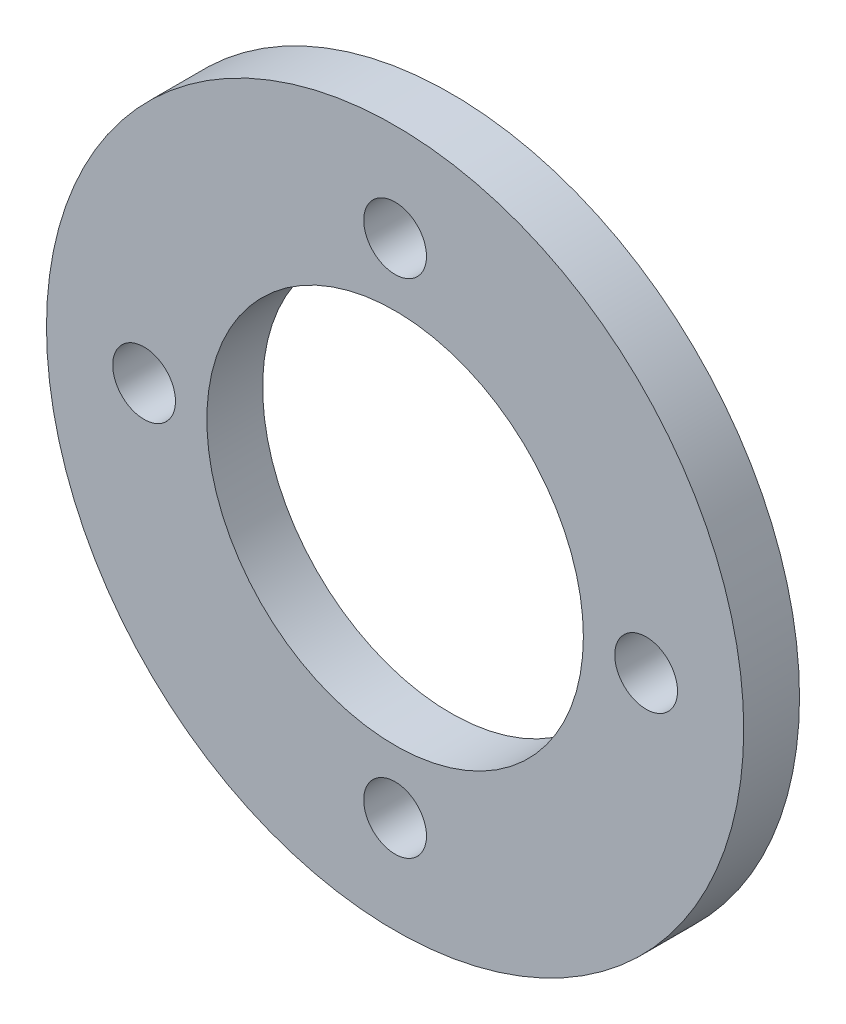
ISO-10303-21;
HEADER;
FILE_DESCRIPTION(('STEP AP214'),'2;1');
FILE_NAME('part.step','',(''),(''),'','','');
FILE_SCHEMA(('AUTOMOTIVE_DESIGN { 1 0 10303 214 1 1 1 1 }'));
ENDSEC;
DATA;
#1=APPLICATION_CONTEXT('core data for automotive mechanical design processes');
#2=APPLICATION_PROTOCOL_DEFINITION('international standard','automotive_design',2000,#1);
#3=PRODUCT_CONTEXT('',#1,'mechanical');
#4=PRODUCT('Part','Part','',(#3));
#5=PRODUCT_RELATED_PRODUCT_CATEGORY('part','',(#4));
#6=PRODUCT_DEFINITION_FORMATION('','',#4);
#7=PRODUCT_DEFINITION_CONTEXT('part definition',#1,'design');
#8=PRODUCT_DEFINITION('design','',#6,#7);
#9=PRODUCT_DEFINITION_SHAPE('','',#8);
#10=(LENGTH_UNIT() NAMED_UNIT(*) SI_UNIT(.MILLI.,.METRE.));
#11=(NAMED_UNIT(*) PLANE_ANGLE_UNIT() SI_UNIT($,.RADIAN.));
#12=(NAMED_UNIT(*) SI_UNIT($,.STERADIAN.) SOLID_ANGLE_UNIT());
#13=UNCERTAINTY_MEASURE_WITH_UNIT(LENGTH_MEASURE(1.E-05),#10,'distance_accuracy_value','');
#14=(GEOMETRIC_REPRESENTATION_CONTEXT(3) GLOBAL_UNCERTAINTY_ASSIGNED_CONTEXT((#13)) GLOBAL_UNIT_ASSIGNED_CONTEXT((#10,
#11,#12)) REPRESENTATION_CONTEXT('',''));
#15=CARTESIAN_POINT('',(0.,0.,0.));
#16=DIRECTION('',(0.,0.,1.));
#17=DIRECTION('',(1.,0.,0.));
#18=AXIS2_PLACEMENT_3D('',#15,#16,#17);
#19=CARTESIAN_POINT('',(0.,0.,4.));
#20=DIRECTION('',(0.,0.,1.));
#21=DIRECTION('',(1.,0.,0.));
#22=AXIS2_PLACEMENT_3D('',#19,#20,#21);
#23=PLANE('',#22);
#24=CARTESIAN_POINT('',(0.,18.,4.));
#25=DIRECTION('',(0.,0.,1.));
#26=DIRECTION('',(1.,0.,0.));
#27=AXIS2_PLACEMENT_3D('',#24,#25,#26);
#28=CIRCLE('',#27,2.25);
#29=CARTESIAN_POINT('',(2.25,18.,4.));
#30=VERTEX_POINT('',#29);
#31=EDGE_CURVE('E83',#30,#30,#28,.T.);
#32=ORIENTED_EDGE('',*,*,#31,.F.);
#33=EDGE_LOOP('',(#32));
#34=FACE_BOUND('',#33,.T.);
#35=CARTESIAN_POINT('',(18.0000000000005,5.09386405508807E-13,4.));
#36=DIRECTION('',(0.,0.,1.));
#37=DIRECTION('',(1.,0.,0.));
#38=AXIS2_PLACEMENT_3D('',#35,#36,#37);
#39=CIRCLE('',#38,2.25);
#40=CARTESIAN_POINT('',(20.2500000000005,5.09386405508807E-13,4.));
#41=VERTEX_POINT('',#40);
#42=EDGE_CURVE('E75',#41,#41,#39,.T.);
#43=ORIENTED_EDGE('',*,*,#42,.F.);
#44=EDGE_LOOP('',(#43));
#45=FACE_BOUND('',#44,.T.);
#46=CARTESIAN_POINT('',(1.01877281101761E-12,-18.,4.));
#47=DIRECTION('',(0.,0.,1.));
#48=DIRECTION('',(1.,0.,0.));
#49=AXIS2_PLACEMENT_3D('',#46,#47,#48);
#50=CIRCLE('',#49,2.25);
#51=CARTESIAN_POINT('',(2.25000000000102,-18.,4.));
#52=VERTEX_POINT('',#51);
#53=EDGE_CURVE('E67',#52,#52,#50,.T.);
#54=ORIENTED_EDGE('',*,*,#53,.F.);
#55=EDGE_LOOP('',(#54));
#56=FACE_BOUND('',#55,.T.);
#57=CARTESIAN_POINT('',(-17.9999999999995,-5.11590769747272E-13,4.));
#58=DIRECTION('',(0.,0.,1.));
#59=DIRECTION('',(1.,0.,0.));
#60=AXIS2_PLACEMENT_3D('',#57,#58,#59);
#61=CIRCLE('',#60,2.25);
#62=CARTESIAN_POINT('',(-15.7499999999995,-5.11590769747272E-13,4.));
#63=VERTEX_POINT('',#62);
#64=EDGE_CURVE('E59',#63,#63,#61,.T.);
#65=ORIENTED_EDGE('',*,*,#64,.F.);
#66=EDGE_LOOP('',(#65));
#67=FACE_BOUND('',#66,.T.);
#68=CARTESIAN_POINT('',(0.,0.,4.));
#69=DIRECTION('',(0.,0.,1.));
#70=DIRECTION('',(1.,0.,0.));
#71=AXIS2_PLACEMENT_3D('',#68,#69,#70);
#72=CIRCLE('',#71,25.);
#73=CARTESIAN_POINT('',(25.,0.,4.));
#74=VERTEX_POINT('',#73);
#75=EDGE_CURVE('E10',#74,#74,#72,.T.);
#76=ORIENTED_EDGE('',*,*,#75,.T.);
#77=EDGE_LOOP('',(#76));
#78=FACE_BOUND('',#77,.T.);
#79=CARTESIAN_POINT('',(0.,0.,4.));
#80=DIRECTION('',(0.,0.,1.));
#81=DIRECTION('',(1.,0.,0.));
#82=AXIS2_PLACEMENT_3D('',#79,#80,#81);
#83=CIRCLE('',#82,13.5);
#84=CARTESIAN_POINT('',(13.5,0.,4.));
#85=VERTEX_POINT('',#84);
#86=EDGE_CURVE('E49',#85,#85,#83,.T.);
#87=ORIENTED_EDGE('',*,*,#86,.F.);
#88=EDGE_LOOP('',(#87));
#89=FACE_BOUND('',#88,.T.);
#90=ADVANCED_FACE('F36',(#34,#45,#56,#67,#78,#89),#23,.T.);
#91=CARTESIAN_POINT('',(0.,0.,0.));
#92=DIRECTION('',(0.,0.,1.));
#93=DIRECTION('',(1.,0.,0.));
#94=AXIS2_PLACEMENT_3D('',#91,#92,#93);
#95=PLANE('',#94);
#96=CARTESIAN_POINT('',(0.,18.,0.));
#97=DIRECTION('',(0.,0.,1.));
#98=DIRECTION('',(1.,0.,0.));
#99=AXIS2_PLACEMENT_3D('',#96,#97,#98);
#100=CIRCLE('',#99,2.25);
#101=CARTESIAN_POINT('',(2.25,18.,0.));
#102=VERTEX_POINT('',#101);
#103=EDGE_CURVE('E55',#102,#102,#100,.T.);
#104=ORIENTED_EDGE('',*,*,#103,.T.);
#105=EDGE_LOOP('',(#104));
#106=FACE_BOUND('',#105,.T.);
#107=CARTESIAN_POINT('',(18.0000000000005,5.09386405508807E-13,0.));
#108=DIRECTION('',(0.,0.,1.));
#109=DIRECTION('',(1.,0.,0.));
#110=AXIS2_PLACEMENT_3D('',#107,#108,#109);
#111=CIRCLE('',#110,2.25);
#112=CARTESIAN_POINT('',(20.2500000000005,5.09386405508807E-13,0.));
#113=VERTEX_POINT('',#112);
#114=EDGE_CURVE('E79',#113,#113,#111,.T.);
#115=ORIENTED_EDGE('',*,*,#114,.T.);
#116=EDGE_LOOP('',(#115));
#117=FACE_BOUND('',#116,.T.);
#118=CARTESIAN_POINT('',(1.01877281101761E-12,-18.,0.));
#119=DIRECTION('',(0.,0.,1.));
#120=DIRECTION('',(1.,0.,0.));
#121=AXIS2_PLACEMENT_3D('',#118,#119,#120);
#122=CIRCLE('',#121,2.25);
#123=CARTESIAN_POINT('',(2.25000000000102,-18.,0.));
#124=VERTEX_POINT('',#123);
#125=EDGE_CURVE('E71',#124,#124,#122,.T.);
#126=ORIENTED_EDGE('',*,*,#125,.T.);
#127=EDGE_LOOP('',(#126));
#128=FACE_BOUND('',#127,.T.);
#129=CARTESIAN_POINT('',(-17.9999999999995,-5.11590769747272E-13,0.));
#130=DIRECTION('',(0.,0.,1.));
#131=DIRECTION('',(1.,0.,0.));
#132=AXIS2_PLACEMENT_3D('',#129,#130,#131);
#133=CIRCLE('',#132,2.25);
#134=CARTESIAN_POINT('',(-15.7499999999995,-5.11590769747272E-13,0.));
#135=VERTEX_POINT('',#134);
#136=EDGE_CURVE('E63',#135,#135,#133,.T.);
#137=ORIENTED_EDGE('',*,*,#136,.T.);
#138=EDGE_LOOP('',(#137));
#139=FACE_BOUND('',#138,.T.);
#140=CARTESIAN_POINT('',(0.,0.,0.));
#141=DIRECTION('',(0.,0.,1.));
#142=DIRECTION('',(1.,0.,0.));
#143=AXIS2_PLACEMENT_3D('',#140,#141,#142);
#144=CIRCLE('',#143,25.);
#145=CARTESIAN_POINT('',(25.,0.,0.));
#146=VERTEX_POINT('',#145);
#147=EDGE_CURVE('E40',#146,#146,#144,.T.);
#148=ORIENTED_EDGE('',*,*,#147,.F.);
#149=EDGE_LOOP('',(#148));
#150=FACE_BOUND('',#149,.T.);
#151=CARTESIAN_POINT('',(0.,0.,0.));
#152=DIRECTION('',(0.,0.,1.));
#153=DIRECTION('',(1.,0.,0.));
#154=AXIS2_PLACEMENT_3D('',#151,#152,#153);
#155=CIRCLE('',#154,13.5);
#156=CARTESIAN_POINT('',(13.5,0.,0.));
#157=VERTEX_POINT('',#156);
#158=EDGE_CURVE('E51',#157,#157,#155,.T.);
#159=ORIENTED_EDGE('',*,*,#158,.T.);
#160=EDGE_LOOP('',(#159));
#161=FACE_BOUND('',#160,.T.);
#162=ADVANCED_FACE('F91',(#106,#117,#128,#139,#150,#161),#95,.F.);
#163=CARTESIAN_POINT('',(0.,0.,4.));
#164=DIRECTION('',(0.,0.,-1.));
#165=DIRECTION('',(-1.,0.,0.));
#166=AXIS2_PLACEMENT_3D('',#163,#164,#165);
#167=CYLINDRICAL_SURFACE('',#166,25.);
#168=ORIENTED_EDGE('',*,*,#75,.F.);
#169=EDGE_LOOP('',(#168));
#170=FACE_BOUND('',#169,.T.);
#171=ORIENTED_EDGE('',*,*,#147,.T.);
#172=EDGE_LOOP('',(#171));
#173=FACE_BOUND('',#172,.T.);
#174=ADVANCED_FACE('F38',(#170,#173),#167,.T.);
#175=CARTESIAN_POINT('',(0.,0.,4.));
#176=DIRECTION('',(0.,0.,-1.));
#177=DIRECTION('',(-1.,0.,0.));
#178=AXIS2_PLACEMENT_3D('',#175,#176,#177);
#179=CYLINDRICAL_SURFACE('',#178,13.5);
#180=ORIENTED_EDGE('',*,*,#86,.T.);
#181=EDGE_LOOP('',(#180));
#182=FACE_BOUND('',#181,.T.);
#183=ORIENTED_EDGE('',*,*,#158,.F.);
#184=EDGE_LOOP('',(#183));
#185=FACE_BOUND('',#184,.T.);
#186=ADVANCED_FACE('F112',(#182,#185),#179,.F.);
#187=CARTESIAN_POINT('',(-17.9999999999995,-5.11590769747272E-13,0.));
#188=DIRECTION('',(0.,0.,1.));
#189=DIRECTION('',(1.,0.,0.));
#190=AXIS2_PLACEMENT_3D('',#187,#188,#189);
#191=CYLINDRICAL_SURFACE('',#190,2.25);
#192=ORIENTED_EDGE('',*,*,#136,.F.);
#193=EDGE_LOOP('',(#192));
#194=FACE_BOUND('',#193,.T.);
#195=ORIENTED_EDGE('',*,*,#64,.T.);
#196=EDGE_LOOP('',(#195));
#197=FACE_BOUND('',#196,.T.);
#198=ADVANCED_FACE('F115',(#194,#197),#191,.F.);
#199=CARTESIAN_POINT('',(1.01877281101761E-12,-18.,0.));
#200=DIRECTION('',(0.,0.,1.));
#201=DIRECTION('',(1.,0.,0.));
#202=AXIS2_PLACEMENT_3D('',#199,#200,#201);
#203=CYLINDRICAL_SURFACE('',#202,2.25);
#204=ORIENTED_EDGE('',*,*,#125,.F.);
#205=EDGE_LOOP('',(#204));
#206=FACE_BOUND('',#205,.T.);
#207=ORIENTED_EDGE('',*,*,#53,.T.);
#208=EDGE_LOOP('',(#207));
#209=FACE_BOUND('',#208,.T.);
#210=ADVANCED_FACE('F127',(#206,#209),#203,.F.);
#211=CARTESIAN_POINT('',(18.0000000000005,5.09386405508807E-13,0.));
#212=DIRECTION('',(0.,0.,1.));
#213=DIRECTION('',(1.,0.,0.));
#214=AXIS2_PLACEMENT_3D('',#211,#212,#213);
#215=CYLINDRICAL_SURFACE('',#214,2.25);
#216=ORIENTED_EDGE('',*,*,#114,.F.);
#217=EDGE_LOOP('',(#216));
#218=FACE_BOUND('',#217,.T.);
#219=ORIENTED_EDGE('',*,*,#42,.T.);
#220=EDGE_LOOP('',(#219));
#221=FACE_BOUND('',#220,.T.);
#222=ADVANCED_FACE('F97',(#218,#221),#215,.F.);
#223=CARTESIAN_POINT('',(0.,18.,0.));
#224=DIRECTION('',(0.,0.,1.));
#225=DIRECTION('',(1.,0.,0.));
#226=AXIS2_PLACEMENT_3D('',#223,#224,#225);
#227=CYLINDRICAL_SURFACE('',#226,2.25);
#228=ORIENTED_EDGE('',*,*,#103,.F.);
#229=EDGE_LOOP('',(#228));
#230=FACE_BOUND('',#229,.T.);
#231=ORIENTED_EDGE('',*,*,#31,.T.);
#232=EDGE_LOOP('',(#231));
#233=FACE_BOUND('',#232,.T.);
#234=ADVANCED_FACE('F94',(#230,#233),#227,.F.);
#235=CLOSED_SHELL('',(#90,#162,#174,#186,#198,#210,#222,#234));
#236=MANIFOLD_SOLID_BREP('B2',#235);
#237=ADVANCED_BREP_SHAPE_REPRESENTATION('',(#18,#236),#14);
#238=SHAPE_DEFINITION_REPRESENTATION(#9,#237);
ENDSEC;
END-ISO-10303-21;
